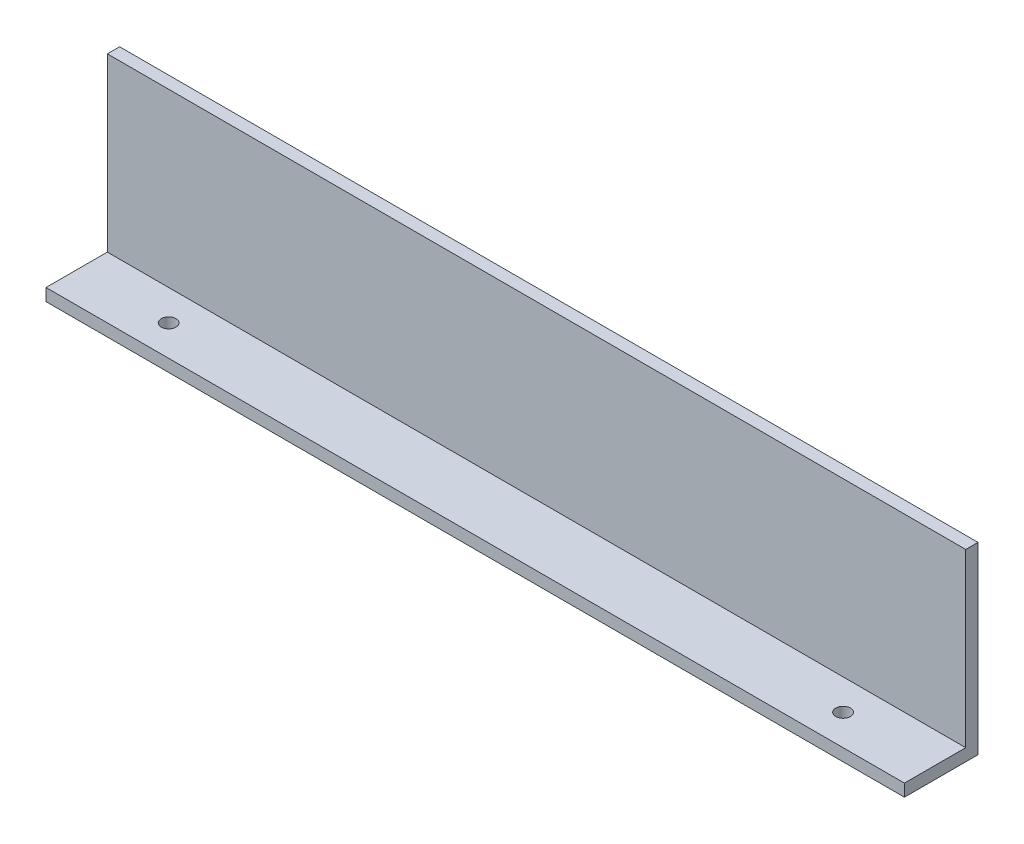
ISO-10303-21;
HEADER;
FILE_DESCRIPTION(('STEP AP214'),'2;1');
FILE_NAME('part.step','',(''),(''),'','','');
FILE_SCHEMA(('AUTOMOTIVE_DESIGN { 1 0 10303 214 1 1 1 1 }'));
ENDSEC;
DATA;
#1=APPLICATION_CONTEXT('core data for automotive mechanical design processes');
#2=APPLICATION_PROTOCOL_DEFINITION('international standard','automotive_design',2000,#1);
#3=PRODUCT_CONTEXT('',#1,'mechanical');
#4=PRODUCT('Part','Part','',(#3));
#5=PRODUCT_RELATED_PRODUCT_CATEGORY('part','',(#4));
#6=PRODUCT_DEFINITION_FORMATION('','',#4);
#7=PRODUCT_DEFINITION_CONTEXT('part definition',#1,'design');
#8=PRODUCT_DEFINITION('design','',#6,#7);
#9=PRODUCT_DEFINITION_SHAPE('','',#8);
#10=(LENGTH_UNIT() NAMED_UNIT(*) SI_UNIT(.MILLI.,.METRE.));
#11=(NAMED_UNIT(*) PLANE_ANGLE_UNIT() SI_UNIT($,.RADIAN.));
#12=(NAMED_UNIT(*) SI_UNIT($,.STERADIAN.) SOLID_ANGLE_UNIT());
#13=UNCERTAINTY_MEASURE_WITH_UNIT(LENGTH_MEASURE(1.E-05),#10,'distance_accuracy_value','');
#14=(GEOMETRIC_REPRESENTATION_CONTEXT(3) GLOBAL_UNCERTAINTY_ASSIGNED_CONTEXT((#13)) GLOBAL_UNIT_ASSIGNED_CONTEXT((#10,
#11,#12)) REPRESENTATION_CONTEXT('',''));
#15=CARTESIAN_POINT('',(0.,0.,0.));
#16=DIRECTION('',(0.,0.,1.));
#17=DIRECTION('',(1.,0.,0.));
#18=AXIS2_PLACEMENT_3D('',#15,#16,#17);
#19=CARTESIAN_POINT('',(0.,0.,10.));
#20=DIRECTION('',(0.,0.,-1.));
#21=DIRECTION('',(-1.,0.,0.));
#22=AXIS2_PLACEMENT_3D('',#19,#20,#21);
#23=PLANE('',#22);
#24=DIRECTION('',(-1.,0.,0.));
#25=VECTOR('',#24,1.);
#26=CARTESIAN_POINT('',(-350.,-65.,10.));
#27=LINE('',#26,#25);
#28=CARTESIAN_POINT('',(350.,-65.,10.));
#29=VERTEX_POINT('',#28);
#30=CARTESIAN_POINT('',(-350.,-65.,10.));
#31=VERTEX_POINT('',#30);
#32=EDGE_CURVE('E50',#29,#31,#27,.T.);
#33=ORIENTED_EDGE('',*,*,#32,.F.);
#34=DIRECTION('',(0.,1.,0.));
#35=VECTOR('',#34,1.);
#36=CARTESIAN_POINT('',(350.,-75.,10.));
#37=LINE('',#36,#35);
#38=CARTESIAN_POINT('',(350.,75.,10.));
#39=VERTEX_POINT('',#38);
#40=EDGE_CURVE('E88',#29,#39,#37,.T.);
#41=ORIENTED_EDGE('',*,*,#40,.T.);
#42=DIRECTION('',(-1.,0.,0.));
#43=VECTOR('',#42,1.);
#44=CARTESIAN_POINT('',(-350.,75.,10.));
#45=LINE('',#44,#43);
#46=CARTESIAN_POINT('',(-350.,75.,10.));
#47=VERTEX_POINT('',#46);
#48=EDGE_CURVE('E56',#39,#47,#45,.T.);
#49=ORIENTED_EDGE('',*,*,#48,.T.);
#50=DIRECTION('',(0.,-1.,0.));
#51=VECTOR('',#50,1.);
#52=CARTESIAN_POINT('',(-350.,-75.,10.));
#53=LINE('',#52,#51);
#54=EDGE_CURVE('E99',#47,#31,#53,.T.);
#55=ORIENTED_EDGE('',*,*,#54,.T.);
#56=EDGE_LOOP('',(#33,#41,#49,#55));
#57=FACE_BOUND('',#56,.T.);
#58=ADVANCED_FACE('F35',(#57),#23,.F.);
#59=CARTESIAN_POINT('',(350.,-75.,10.));
#60=DIRECTION('',(-1.,0.,0.));
#61=DIRECTION('',(0.,0.,1.));
#62=AXIS2_PLACEMENT_3D('',#59,#60,#61);
#63=PLANE('',#62);
#64=DIRECTION('',(0.,1.,0.));
#65=VECTOR('',#64,1.);
#66=CARTESIAN_POINT('',(350.,-75.,0.));
#67=LINE('',#66,#65);
#68=CARTESIAN_POINT('',(350.,-75.,0.));
#69=VERTEX_POINT('',#68);
#70=CARTESIAN_POINT('',(350.,75.,0.));
#71=VERTEX_POINT('',#70);
#72=EDGE_CURVE('E95',#69,#71,#67,.T.);
#73=ORIENTED_EDGE('',*,*,#72,.T.);
#74=DIRECTION('',(0.,0.,-1.));
#75=VECTOR('',#74,1.);
#76=CARTESIAN_POINT('',(350.,75.,10.));
#77=LINE('',#76,#75);
#78=EDGE_CURVE('E11',#39,#71,#77,.T.);
#79=ORIENTED_EDGE('',*,*,#78,.F.);
#80=ORIENTED_EDGE('',*,*,#40,.F.);
#81=DIRECTION('',(0.,0.,-1.));
#82=VECTOR('',#81,1.);
#83=CARTESIAN_POINT('',(350.,-65.,60.));
#84=LINE('',#83,#82);
#85=CARTESIAN_POINT('',(350.,-65.,60.));
#86=VERTEX_POINT('',#85);
#87=EDGE_CURVE('E103',#86,#29,#84,.T.);
#88=ORIENTED_EDGE('',*,*,#87,.F.);
#89=DIRECTION('',(0.,1.,0.));
#90=VECTOR('',#89,1.);
#91=CARTESIAN_POINT('',(350.,-75.,60.));
#92=LINE('',#91,#90);
#93=CARTESIAN_POINT('',(350.,-75.,60.));
#94=VERTEX_POINT('',#93);
#95=EDGE_CURVE('E98',#94,#86,#92,.T.);
#96=ORIENTED_EDGE('',*,*,#95,.F.);
#97=DIRECTION('',(0.,0.,-1.));
#98=VECTOR('',#97,1.);
#99=CARTESIAN_POINT('',(350.,-75.,10.));
#100=LINE('',#99,#98);
#101=EDGE_CURVE('E81',#94,#69,#100,.T.);
#102=ORIENTED_EDGE('',*,*,#101,.T.);
#103=EDGE_LOOP('',(#73,#79,#80,#88,#96,#102));
#104=FACE_BOUND('',#103,.T.);
#105=ADVANCED_FACE('F37',(#104),#63,.F.);
#106=CARTESIAN_POINT('',(-350.,75.,10.));
#107=DIRECTION('',(0.,-1.,0.));
#108=DIRECTION('',(0.,0.,-1.));
#109=AXIS2_PLACEMENT_3D('',#106,#107,#108);
#110=PLANE('',#109);
#111=DIRECTION('',(-1.,0.,0.));
#112=VECTOR('',#111,1.);
#113=CARTESIAN_POINT('',(-350.,75.,0.));
#114=LINE('',#113,#112);
#115=CARTESIAN_POINT('',(-350.,75.,0.));
#116=VERTEX_POINT('',#115);
#117=EDGE_CURVE('E102',#71,#116,#114,.T.);
#118=ORIENTED_EDGE('',*,*,#117,.T.);
#119=DIRECTION('',(0.,0.,-1.));
#120=VECTOR('',#119,1.);
#121=CARTESIAN_POINT('',(-350.,75.,10.));
#122=LINE('',#121,#120);
#123=EDGE_CURVE('E43',#47,#116,#122,.T.);
#124=ORIENTED_EDGE('',*,*,#123,.F.);
#125=ORIENTED_EDGE('',*,*,#48,.F.);
#126=ORIENTED_EDGE('',*,*,#78,.T.);
#127=EDGE_LOOP('',(#118,#124,#125,#126));
#128=FACE_BOUND('',#127,.T.);
#129=ADVANCED_FACE('F119',(#128),#110,.F.);
#130=CARTESIAN_POINT('',(-350.,-75.,10.));
#131=DIRECTION('',(1.,0.,0.));
#132=DIRECTION('',(0.,0.,-1.));
#133=AXIS2_PLACEMENT_3D('',#130,#131,#132);
#134=PLANE('',#133);
#135=DIRECTION('',(0.,-1.,0.));
#136=VECTOR('',#135,1.);
#137=CARTESIAN_POINT('',(-350.,-75.,0.));
#138=LINE('',#137,#136);
#139=CARTESIAN_POINT('',(-350.,-75.,0.));
#140=VERTEX_POINT('',#139);
#141=EDGE_CURVE('E89',#116,#140,#138,.T.);
#142=ORIENTED_EDGE('',*,*,#141,.T.);
#143=DIRECTION('',(0.,0.,-1.));
#144=VECTOR('',#143,1.);
#145=CARTESIAN_POINT('',(-350.,-75.,10.));
#146=LINE('',#145,#144);
#147=CARTESIAN_POINT('',(-350.,-75.,60.));
#148=VERTEX_POINT('',#147);
#149=EDGE_CURVE('E84',#148,#140,#146,.T.);
#150=ORIENTED_EDGE('',*,*,#149,.F.);
#151=DIRECTION('',(0.,-1.,0.));
#152=VECTOR('',#151,1.);
#153=CARTESIAN_POINT('',(-350.,-75.,60.));
#154=LINE('',#153,#152);
#155=CARTESIAN_POINT('',(-350.,-65.,60.));
#156=VERTEX_POINT('',#155);
#157=EDGE_CURVE('E139',#156,#148,#154,.T.);
#158=ORIENTED_EDGE('',*,*,#157,.F.);
#159=DIRECTION('',(0.,0.,-1.));
#160=VECTOR('',#159,1.);
#161=CARTESIAN_POINT('',(-350.,-65.,60.));
#162=LINE('',#161,#160);
#163=EDGE_CURVE('E107',#156,#31,#162,.T.);
#164=ORIENTED_EDGE('',*,*,#163,.T.);
#165=ORIENTED_EDGE('',*,*,#54,.F.);
#166=ORIENTED_EDGE('',*,*,#123,.T.);
#167=EDGE_LOOP('',(#142,#150,#158,#164,#165,#166));
#168=FACE_BOUND('',#167,.T.);
#169=ADVANCED_FACE('F116',(#168),#134,.F.);
#170=CARTESIAN_POINT('',(-350.,-75.,10.));
#171=DIRECTION('',(0.,1.,0.));
#172=DIRECTION('',(0.,0.,1.));
#173=AXIS2_PLACEMENT_3D('',#170,#171,#172);
#174=PLANE('',#173);
#175=CARTESIAN_POINT('',(275.,-75.,35.));
#176=DIRECTION('',(0.,1.,0.));
#177=DIRECTION('',(0.,0.,1.));
#178=AXIS2_PLACEMENT_3D('',#175,#176,#177);
#179=CIRCLE('',#178,6.00000000000001);
#180=CARTESIAN_POINT('',(275.,-75.,41.));
#181=VERTEX_POINT('',#180);
#182=EDGE_CURVE('E156',#181,#181,#179,.T.);
#183=ORIENTED_EDGE('',*,*,#182,.T.);
#184=EDGE_LOOP('',(#183));
#185=FACE_BOUND('',#184,.T.);
#186=CARTESIAN_POINT('',(-275.,-75.,35.));
#187=DIRECTION('',(0.,1.,0.));
#188=DIRECTION('',(0.,0.,1.));
#189=AXIS2_PLACEMENT_3D('',#186,#187,#188);
#190=CIRCLE('',#189,6.00000000000001);
#191=CARTESIAN_POINT('',(-275.,-75.,41.));
#192=VERTEX_POINT('',#191);
#193=EDGE_CURVE('E140',#192,#192,#190,.T.);
#194=ORIENTED_EDGE('',*,*,#193,.T.);
#195=EDGE_LOOP('',(#194));
#196=FACE_BOUND('',#195,.T.);
#197=DIRECTION('',(1.,0.,0.));
#198=VECTOR('',#197,1.);
#199=CARTESIAN_POINT('',(-350.,-75.,0.));
#200=LINE('',#199,#198);
#201=EDGE_CURVE('E76',#140,#69,#200,.T.);
#202=ORIENTED_EDGE('',*,*,#201,.T.);
#203=ORIENTED_EDGE('',*,*,#101,.F.);
#204=DIRECTION('',(1.,0.,0.));
#205=VECTOR('',#204,1.);
#206=CARTESIAN_POINT('',(-350.,-75.,60.));
#207=LINE('',#206,#205);
#208=EDGE_CURVE('E135',#148,#94,#207,.T.);
#209=ORIENTED_EDGE('',*,*,#208,.F.);
#210=ORIENTED_EDGE('',*,*,#149,.T.);
#211=EDGE_LOOP('',(#202,#203,#209,#210));
#212=FACE_BOUND('',#211,.T.);
#213=ADVANCED_FACE('F78',(#185,#196,#212),#174,.F.);
#214=CARTESIAN_POINT('',(0.,0.,0.));
#215=DIRECTION('',(0.,0.,-1.));
#216=DIRECTION('',(-1.,0.,0.));
#217=AXIS2_PLACEMENT_3D('',#214,#215,#216);
#218=PLANE('',#217);
#219=ORIENTED_EDGE('',*,*,#72,.F.);
#220=ORIENTED_EDGE('',*,*,#201,.F.);
#221=ORIENTED_EDGE('',*,*,#141,.F.);
#222=ORIENTED_EDGE('',*,*,#117,.F.);
#223=EDGE_LOOP('',(#219,#220,#221,#222));
#224=FACE_BOUND('',#223,.T.);
#225=ADVANCED_FACE('F101',(#224),#218,.T.);
#226=CARTESIAN_POINT('',(-350.,-65.,60.));
#227=DIRECTION('',(0.,-1.,0.));
#228=DIRECTION('',(0.,0.,-1.));
#229=AXIS2_PLACEMENT_3D('',#226,#227,#228);
#230=PLANE('',#229);
#231=CARTESIAN_POINT('',(275.,-65.,35.));
#232=DIRECTION('',(0.,1.,0.));
#233=DIRECTION('',(0.,0.,1.));
#234=AXIS2_PLACEMENT_3D('',#231,#232,#233);
#235=CIRCLE('',#234,6.00000000000001);
#236=CARTESIAN_POINT('',(275.,-65.,41.));
#237=VERTEX_POINT('',#236);
#238=EDGE_CURVE('E153',#237,#237,#235,.T.);
#239=ORIENTED_EDGE('',*,*,#238,.F.);
#240=EDGE_LOOP('',(#239));
#241=FACE_BOUND('',#240,.T.);
#242=CARTESIAN_POINT('',(-275.,-65.,35.));
#243=DIRECTION('',(0.,1.,0.));
#244=DIRECTION('',(0.,0.,1.));
#245=AXIS2_PLACEMENT_3D('',#242,#243,#244);
#246=CIRCLE('',#245,6.00000000000001);
#247=CARTESIAN_POINT('',(-275.,-65.,41.));
#248=VERTEX_POINT('',#247);
#249=EDGE_CURVE('E150',#248,#248,#246,.T.);
#250=ORIENTED_EDGE('',*,*,#249,.F.);
#251=EDGE_LOOP('',(#250));
#252=FACE_BOUND('',#251,.T.);
#253=ORIENTED_EDGE('',*,*,#32,.T.);
#254=ORIENTED_EDGE('',*,*,#163,.F.);
#255=DIRECTION('',(-1.,0.,0.));
#256=VECTOR('',#255,1.);
#257=CARTESIAN_POINT('',(-350.,-65.,60.));
#258=LINE('',#257,#256);
#259=EDGE_CURVE('E128',#86,#156,#258,.T.);
#260=ORIENTED_EDGE('',*,*,#259,.F.);
#261=ORIENTED_EDGE('',*,*,#87,.T.);
#262=EDGE_LOOP('',(#253,#254,#260,#261));
#263=FACE_BOUND('',#262,.T.);
#264=ADVANCED_FACE('F124',(#241,#252,#263),#230,.F.);
#265=CARTESIAN_POINT('',(0.,0.,60.));
#266=DIRECTION('',(0.,0.,-1.));
#267=DIRECTION('',(-1.,0.,0.));
#268=AXIS2_PLACEMENT_3D('',#265,#266,#267);
#269=PLANE('',#268);
#270=ORIENTED_EDGE('',*,*,#157,.T.);
#271=ORIENTED_EDGE('',*,*,#208,.T.);
#272=ORIENTED_EDGE('',*,*,#95,.T.);
#273=ORIENTED_EDGE('',*,*,#259,.T.);
#274=EDGE_LOOP('',(#270,#271,#272,#273));
#275=FACE_BOUND('',#274,.T.);
#276=ADVANCED_FACE('F145',(#275),#269,.F.);
#277=CARTESIAN_POINT('',(-275.,-65.,35.));
#278=DIRECTION('',(0.,1.,0.));
#279=DIRECTION('',(0.,0.,1.));
#280=AXIS2_PLACEMENT_3D('',#277,#278,#279);
#281=CYLINDRICAL_SURFACE('',#280,6.00000000000001);
#282=ORIENTED_EDGE('',*,*,#193,.F.);
#283=EDGE_LOOP('',(#282));
#284=FACE_BOUND('',#283,.T.);
#285=ORIENTED_EDGE('',*,*,#249,.T.);
#286=EDGE_LOOP('',(#285));
#287=FACE_BOUND('',#286,.T.);
#288=ADVANCED_FACE('F165',(#284,#287),#281,.F.);
#289=CARTESIAN_POINT('',(275.,-65.,35.));
#290=DIRECTION('',(0.,1.,0.));
#291=DIRECTION('',(0.,0.,1.));
#292=AXIS2_PLACEMENT_3D('',#289,#290,#291);
#293=CYLINDRICAL_SURFACE('',#292,6.00000000000001);
#294=ORIENTED_EDGE('',*,*,#182,.F.);
#295=EDGE_LOOP('',(#294));
#296=FACE_BOUND('',#295,.T.);
#297=ORIENTED_EDGE('',*,*,#238,.T.);
#298=EDGE_LOOP('',(#297));
#299=FACE_BOUND('',#298,.T.);
#300=ADVANCED_FACE('F162',(#296,#299),#293,.F.);
#301=CLOSED_SHELL('',(#58,#105,#129,#169,#213,#225,#264,#276,#288,#300));
#302=MANIFOLD_SOLID_BREP('B2',#301);
#303=ADVANCED_BREP_SHAPE_REPRESENTATION('',(#18,#302),#14);
#304=SHAPE_DEFINITION_REPRESENTATION(#9,#303);
ENDSEC;
END-ISO-10303-21;
